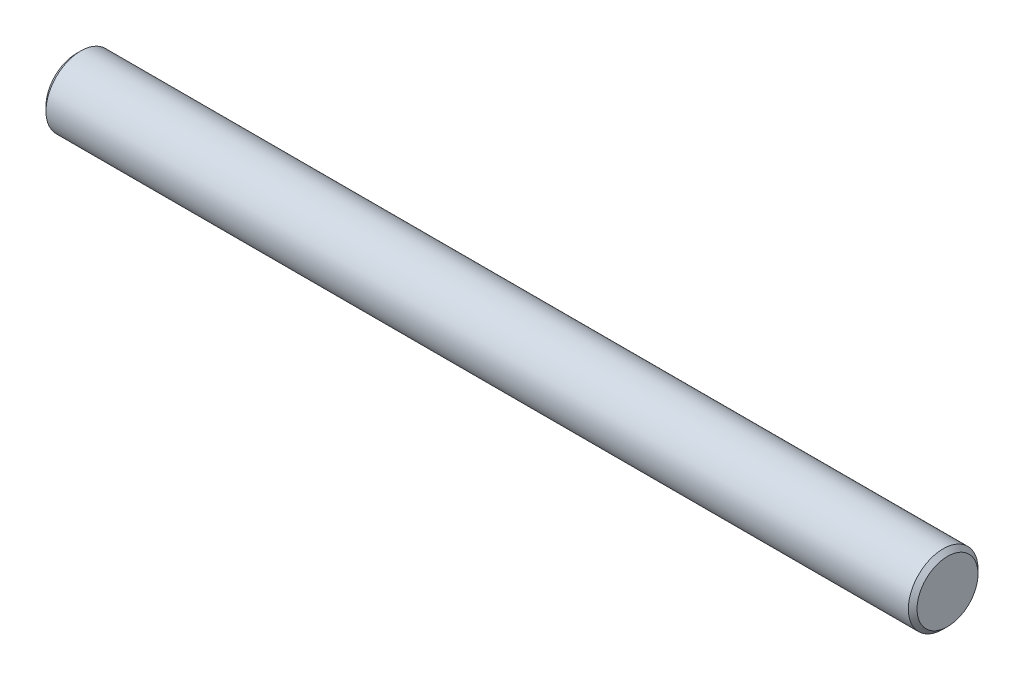
ISO-10303-21;
HEADER;
FILE_DESCRIPTION(('STEP AP214'),'2;1');
FILE_NAME('part.step','',(''),(''),'','','');
FILE_SCHEMA(('AUTOMOTIVE_DESIGN { 1 0 10303 214 1 1 1 1 }'));
ENDSEC;
DATA;
#1=APPLICATION_CONTEXT('core data for automotive mechanical design processes');
#2=APPLICATION_PROTOCOL_DEFINITION('international standard','automotive_design',2000,#1);
#3=PRODUCT_CONTEXT('',#1,'mechanical');
#4=PRODUCT('Part','Part','',(#3));
#5=PRODUCT_RELATED_PRODUCT_CATEGORY('part','',(#4));
#6=PRODUCT_DEFINITION_FORMATION('','',#4);
#7=PRODUCT_DEFINITION_CONTEXT('part definition',#1,'design');
#8=PRODUCT_DEFINITION('design','',#6,#7);
#9=PRODUCT_DEFINITION_SHAPE('','',#8);
#10=(LENGTH_UNIT() NAMED_UNIT(*) SI_UNIT(.MILLI.,.METRE.));
#11=(NAMED_UNIT(*) PLANE_ANGLE_UNIT() SI_UNIT($,.RADIAN.));
#12=(NAMED_UNIT(*) SI_UNIT($,.STERADIAN.) SOLID_ANGLE_UNIT());
#13=UNCERTAINTY_MEASURE_WITH_UNIT(LENGTH_MEASURE(1.E-05),#10,'distance_accuracy_value','');
#14=(GEOMETRIC_REPRESENTATION_CONTEXT(3) GLOBAL_UNCERTAINTY_ASSIGNED_CONTEXT((#13)) GLOBAL_UNIT_ASSIGNED_CONTEXT((#10,
#11,#12)) REPRESENTATION_CONTEXT('',''));
#15=CARTESIAN_POINT('',(0.,0.,0.));
#16=DIRECTION('',(0.,0.,1.));
#17=DIRECTION('',(1.,0.,0.));
#18=AXIS2_PLACEMENT_3D('',#15,#16,#17);
#19=CARTESIAN_POINT('',(50.,0.,0.));
#20=DIRECTION('',(-1.,0.,0.));
#21=DIRECTION('',(0.,0.,1.));
#22=AXIS2_PLACEMENT_3D('',#19,#20,#21);
#23=CYLINDRICAL_SURFACE('',#22,4.);
#24=CARTESIAN_POINT('',(-49.5,0.,0.));
#25=DIRECTION('',(1.,0.,0.));
#26=DIRECTION('',(0.,0.,-1.));
#27=AXIS2_PLACEMENT_3D('',#24,#25,#26);
#28=CIRCLE('',#27,4.);
#29=CARTESIAN_POINT('',(-49.5,0.,-4.));
#30=VERTEX_POINT('',#29);
#31=EDGE_CURVE('E45',#30,#30,#28,.T.);
#32=ORIENTED_EDGE('',*,*,#31,.T.);
#33=EDGE_LOOP('',(#32));
#34=FACE_BOUND('',#33,.T.);
#35=CARTESIAN_POINT('',(49.5,0.,0.));
#36=DIRECTION('',(1.,0.,0.));
#37=DIRECTION('',(0.,0.,-1.));
#38=AXIS2_PLACEMENT_3D('',#35,#36,#37);
#39=CIRCLE('',#38,4.);
#40=CARTESIAN_POINT('',(49.5,0.,-4.));
#41=VERTEX_POINT('',#40);
#42=EDGE_CURVE('E49',#41,#41,#39,.F.);
#43=ORIENTED_EDGE('',*,*,#42,.T.);
#44=EDGE_LOOP('',(#43));
#45=FACE_BOUND('',#44,.T.);
#46=ADVANCED_FACE('F34',(#34,#45),#23,.T.);
#47=CARTESIAN_POINT('',(50.,0.,0.));
#48=DIRECTION('',(1.,0.,0.));
#49=DIRECTION('',(0.,0.,-1.));
#50=AXIS2_PLACEMENT_3D('',#47,#48,#49);
#51=PLANE('',#50);
#52=CARTESIAN_POINT('',(50.,0.,0.));
#53=DIRECTION('',(1.,0.,0.));
#54=DIRECTION('',(0.,0.,-1.));
#55=AXIS2_PLACEMENT_3D('',#52,#53,#54);
#56=CIRCLE('',#55,3.50000000000002);
#57=CARTESIAN_POINT('',(50.,0.,-3.50000000000002));
#58=VERTEX_POINT('',#57);
#59=EDGE_CURVE('E10',#58,#58,#56,.T.);
#60=ORIENTED_EDGE('',*,*,#59,.T.);
#61=EDGE_LOOP('',(#60));
#62=FACE_BOUND('',#61,.T.);
#63=ADVANCED_FACE('F65',(#62),#51,.T.);
#64=CARTESIAN_POINT('',(-50.,0.,0.));
#65=DIRECTION('',(1.,0.,0.));
#66=DIRECTION('',(0.,0.,-1.));
#67=AXIS2_PLACEMENT_3D('',#64,#65,#66);
#68=PLANE('',#67);
#69=CARTESIAN_POINT('',(-50.,0.,0.));
#70=DIRECTION('',(1.,0.,0.));
#71=DIRECTION('',(0.,0.,-1.));
#72=AXIS2_PLACEMENT_3D('',#69,#70,#71);
#73=CIRCLE('',#72,3.5);
#74=CARTESIAN_POINT('',(-50.,0.,-3.5));
#75=VERTEX_POINT('',#74);
#76=EDGE_CURVE('E41',#75,#75,#73,.F.);
#77=ORIENTED_EDGE('',*,*,#76,.T.);
#78=EDGE_LOOP('',(#77));
#79=FACE_BOUND('',#78,.T.);
#80=ADVANCED_FACE('F62',(#79),#68,.F.);
#81=CARTESIAN_POINT('',(-49.5,0.,0.));
#82=DIRECTION('',(1.,0.,0.));
#83=DIRECTION('',(0.,0.,-1.));
#84=AXIS2_PLACEMENT_3D('',#81,#82,#83);
#85=CONICAL_SURFACE('',#84,4.,0.785398163397445);
#86=ORIENTED_EDGE('',*,*,#76,.F.);
#87=EDGE_LOOP('',(#86));
#88=FACE_BOUND('',#87,.T.);
#89=ORIENTED_EDGE('',*,*,#31,.F.);
#90=EDGE_LOOP('',(#89));
#91=FACE_BOUND('',#90,.T.);
#92=ADVANCED_FACE('F58',(#88,#91),#85,.T.);
#93=CARTESIAN_POINT('',(50.,0.,0.));
#94=DIRECTION('',(-1.,0.,0.));
#95=DIRECTION('',(0.,0.,1.));
#96=AXIS2_PLACEMENT_3D('',#93,#94,#95);
#97=CONICAL_SURFACE('',#96,3.50000000000002,0.785398163397431);
#98=ORIENTED_EDGE('',*,*,#42,.F.);
#99=EDGE_LOOP('',(#98));
#100=FACE_BOUND('',#99,.T.);
#101=ORIENTED_EDGE('',*,*,#59,.F.);
#102=EDGE_LOOP('',(#101));
#103=FACE_BOUND('',#102,.T.);
#104=ADVANCED_FACE('F36',(#100,#103),#97,.T.);
#105=CLOSED_SHELL('',(#46,#63,#80,#92,#104));
#106=MANIFOLD_SOLID_BREP('B2',#105);
#107=ADVANCED_BREP_SHAPE_REPRESENTATION('',(#18,#106),#14);
#108=SHAPE_DEFINITION_REPRESENTATION(#9,#107);
ENDSEC;
END-ISO-10303-21;
